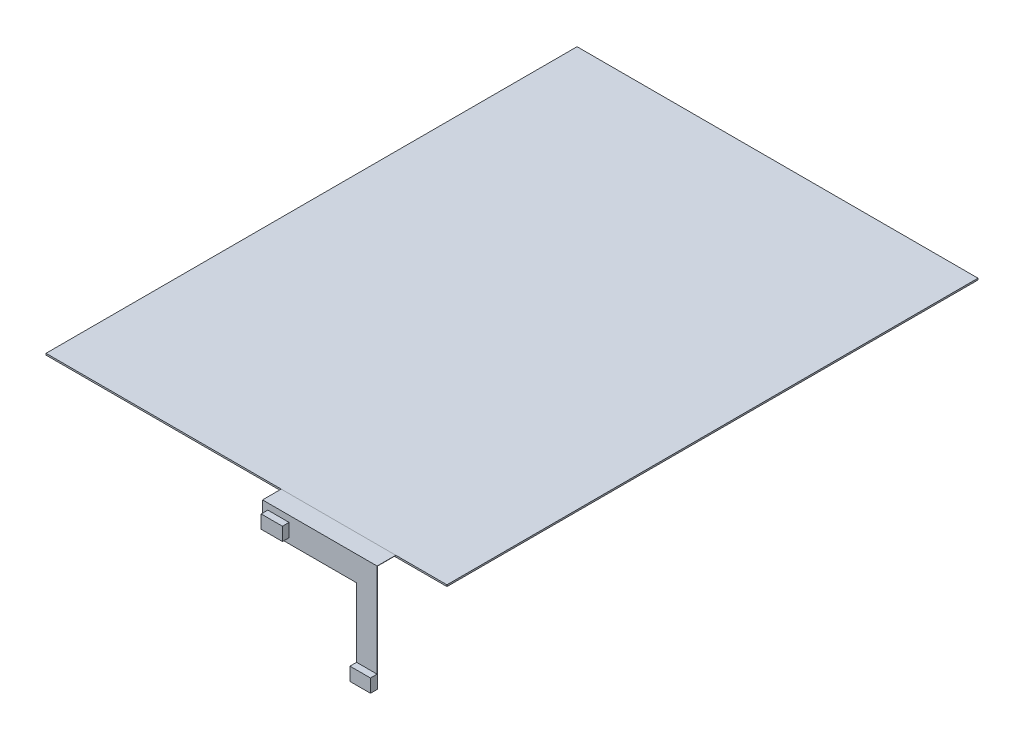
ISO-10303-21;
HEADER;
FILE_DESCRIPTION(('STEP AP214'),'2;1');
FILE_NAME('part.step','',(''),(''),'','','');
FILE_SCHEMA(('AUTOMOTIVE_DESIGN { 1 0 10303 214 1 1 1 1 }'));
ENDSEC;
DATA;
#1=APPLICATION_CONTEXT('core data for automotive mechanical design processes');
#2=APPLICATION_PROTOCOL_DEFINITION('international standard','automotive_design',2000,#1);
#3=PRODUCT_CONTEXT('',#1,'mechanical');
#4=PRODUCT('Part','Part','',(#3));
#5=PRODUCT_RELATED_PRODUCT_CATEGORY('part','',(#4));
#6=PRODUCT_DEFINITION_FORMATION('','',#4);
#7=PRODUCT_DEFINITION_CONTEXT('part definition',#1,'design');
#8=PRODUCT_DEFINITION('design','',#6,#7);
#9=PRODUCT_DEFINITION_SHAPE('','',#8);
#10=(LENGTH_UNIT() NAMED_UNIT(*) SI_UNIT(.MILLI.,.METRE.));
#11=(NAMED_UNIT(*) PLANE_ANGLE_UNIT() SI_UNIT($,.RADIAN.));
#12=(NAMED_UNIT(*) SI_UNIT($,.STERADIAN.) SOLID_ANGLE_UNIT());
#13=UNCERTAINTY_MEASURE_WITH_UNIT(LENGTH_MEASURE(1.E-05),#10,'distance_accuracy_value','');
#14=(GEOMETRIC_REPRESENTATION_CONTEXT(3) GLOBAL_UNCERTAINTY_ASSIGNED_CONTEXT((#13)) GLOBAL_UNIT_ASSIGNED_CONTEXT((#10,
#11,#12)) REPRESENTATION_CONTEXT('',''));
#15=CARTESIAN_POINT('',(0.,0.,0.));
#16=DIRECTION('',(0.,0.,1.));
#17=DIRECTION('',(1.,0.,0.));
#18=AXIS2_PLACEMENT_3D('',#15,#16,#17);
#19=CARTESIAN_POINT('',(56.2333726035956,0.5,107.038276069715));
#20=DIRECTION('',(0.,0.,1.));
#21=DIRECTION('',(1.,0.,0.));
#22=AXIS2_PLACEMENT_3D('',#19,#20,#21);
#23=PLANE('',#22);
#24=DIRECTION('',(-1.,0.,0.));
#25=VECTOR('',#24,1.);
#26=CARTESIAN_POINT('',(48.507284639132,-34.6648367445099,107.038276069715));
#27=LINE('',#26,#25);
#28=CARTESIAN_POINT('',(56.2333726035956,-34.6648367445099,107.038276069715));
#29=VERTEX_POINT('',#28);
#30=CARTESIAN_POINT('',(48.507284639132,-34.6648367445099,107.038276069715));
#31=VERTEX_POINT('',#30);
#32=EDGE_CURVE('E72',#29,#31,#27,.T.);
#33=ORIENTED_EDGE('',*,*,#32,.F.);
#34=DIRECTION('',(0.,1.,0.));
#35=VECTOR('',#34,1.);
#36=CARTESIAN_POINT('',(56.2333726035956,0.5,107.038276069715));
#37=LINE('',#36,#35);
#38=CARTESIAN_POINT('',(56.2333726035956,0.6,107.038276069715));
#39=VERTEX_POINT('',#38);
#40=EDGE_CURVE('E56',#29,#39,#37,.T.);
#41=ORIENTED_EDGE('',*,*,#40,.T.);
#42=DIRECTION('',(1.,0.,0.));
#43=VECTOR('',#42,1.);
#44=CARTESIAN_POINT('',(56.2333726035956,0.6,107.038276069715));
#45=LINE('',#44,#43);
#46=CARTESIAN_POINT('',(13.0840025364802,0.6,107.038276069715));
#47=VERTEX_POINT('',#46);
#48=EDGE_CURVE('E254',#47,#39,#45,.T.);
#49=ORIENTED_EDGE('',*,*,#48,.F.);
#50=DIRECTION('',(0.,1.,0.));
#51=VECTOR('',#50,1.);
#52=CARTESIAN_POINT('',(13.0840025364802,0.5,107.038276069715));
#53=LINE('',#52,#51);
#54=CARTESIAN_POINT('',(13.0840025364802,-8.74016219641922,107.038276069715));
#55=VERTEX_POINT('',#54);
#56=EDGE_CURVE('E261',#55,#47,#53,.T.);
#57=ORIENTED_EDGE('',*,*,#56,.F.);
#58=DIRECTION('',(1.,0.,0.));
#59=VECTOR('',#58,1.);
#60=CARTESIAN_POINT('',(48.507284639132,-8.74016219641922,107.038276069715));
#61=LINE('',#60,#59);
#62=CARTESIAN_POINT('',(48.507284639132,-8.74016219641922,107.038276069715));
#63=VERTEX_POINT('',#62);
#64=EDGE_CURVE('E203',#55,#63,#61,.T.);
#65=ORIENTED_EDGE('',*,*,#64,.T.);
#66=DIRECTION('',(0.,-1.,0.));
#67=VECTOR('',#66,1.);
#68=CARTESIAN_POINT('',(48.507284639132,-39.6648367445099,107.038276069715));
#69=LINE('',#68,#67);
#70=EDGE_CURVE('E208',#63,#31,#69,.T.);
#71=ORIENTED_EDGE('',*,*,#70,.T.);
#72=EDGE_LOOP('',(#33,#41,#49,#57,#65,#71));
#73=FACE_BOUND('',#72,.T.);
#74=DIRECTION('',(1.,0.,0.));
#75=VECTOR('',#74,1.);
#76=CARTESIAN_POINT('',(15.0840025364802,-6.74016219641922,107.038276069715));
#77=LINE('',#76,#75);
#78=CARTESIAN_POINT('',(15.0840025364802,-6.74016219641922,107.038276069715));
#79=VERTEX_POINT('',#78);
#80=CARTESIAN_POINT('',(23.0840025364802,-6.74016219641922,107.038276069715));
#81=VERTEX_POINT('',#80);
#82=EDGE_CURVE('E453',#79,#81,#77,.T.);
#83=ORIENTED_EDGE('',*,*,#82,.F.);
#84=DIRECTION('',(0.,-1.,0.));
#85=VECTOR('',#84,1.);
#86=CARTESIAN_POINT('',(15.0840025364802,-1.74016219641922,107.038276069715));
#87=LINE('',#86,#85);
#88=CARTESIAN_POINT('',(15.0840025364802,-1.74016219641922,107.038276069715));
#89=VERTEX_POINT('',#88);
#90=EDGE_CURVE('E172',#89,#79,#87,.T.);
#91=ORIENTED_EDGE('',*,*,#90,.F.);
#92=DIRECTION('',(-1.,0.,0.));
#93=VECTOR('',#92,1.);
#94=CARTESIAN_POINT('',(15.0840025364802,-1.74016219641922,107.038276069715));
#95=LINE('',#94,#93);
#96=CARTESIAN_POINT('',(23.0840025364802,-1.74016219641922,107.038276069715));
#97=VERTEX_POINT('',#96);
#98=EDGE_CURVE('E168',#97,#89,#95,.T.);
#99=ORIENTED_EDGE('',*,*,#98,.F.);
#100=DIRECTION('',(0.,1.,0.));
#101=VECTOR('',#100,1.);
#102=CARTESIAN_POINT('',(23.0840025364802,-1.74016219641922,107.038276069715));
#103=LINE('',#102,#101);
#104=EDGE_CURVE('E450',#81,#97,#103,.T.);
#105=ORIENTED_EDGE('',*,*,#104,.F.);
#106=EDGE_LOOP('',(#83,#91,#99,#105));
#107=FACE_BOUND('',#106,.T.);
#108=ADVANCED_FACE('F47',(#73,#107),#23,.T.);
#109=CARTESIAN_POINT('',(0.,0.5,0.));
#110=DIRECTION('',(0.,-1.,0.));
#111=DIRECTION('',(0.,0.,-1.));
#112=AXIS2_PLACEMENT_3D('',#109,#110,#111);
#113=PLANE('',#112);
#114=DIRECTION('',(0.,0.,-1.));
#115=VECTOR('',#114,1.);
#116=CARTESIAN_POINT('',(56.2333726035956,0.5,100.));
#117=LINE('',#116,#115);
#118=CARTESIAN_POINT('',(56.2333726035956,0.5,106.938276069715));
#119=VERTEX_POINT('',#118);
#120=CARTESIAN_POINT('',(56.2333726035956,0.5,100.));
#121=VERTEX_POINT('',#120);
#122=EDGE_CURVE('E239',#119,#121,#117,.T.);
#123=ORIENTED_EDGE('',*,*,#122,.F.);
#124=DIRECTION('',(-1.,0.,0.));
#125=VECTOR('',#124,1.);
#126=CARTESIAN_POINT('',(13.0840025364802,0.5,106.938276069715));
#127=LINE('',#126,#125);
#128=CARTESIAN_POINT('',(13.0840025364802,0.5,106.938276069715));
#129=VERTEX_POINT('',#128);
#130=EDGE_CURVE('E211',#119,#129,#127,.T.);
#131=ORIENTED_EDGE('',*,*,#130,.T.);
#132=DIRECTION('',(0.,0.,1.));
#133=VECTOR('',#132,1.);
#134=CARTESIAN_POINT('',(13.0840025364802,0.5,107.038276069715));
#135=LINE('',#134,#133);
#136=CARTESIAN_POINT('',(13.0840025364802,0.5,100.));
#137=VERTEX_POINT('',#136);
#138=EDGE_CURVE('E235',#137,#129,#135,.T.);
#139=ORIENTED_EDGE('',*,*,#138,.F.);
#140=DIRECTION('',(-1.,0.,0.));
#141=VECTOR('',#140,1.);
#142=CARTESIAN_POINT('',(13.0840025364802,0.5,100.));
#143=LINE('',#142,#141);
#144=EDGE_CURVE('E240',#121,#137,#143,.T.);
#145=ORIENTED_EDGE('',*,*,#144,.F.);
#146=EDGE_LOOP('',(#123,#131,#139,#145));
#147=FACE_BOUND('',#146,.T.);
#148=ADVANCED_FACE('F276',(#147),#113,.T.);
#149=CARTESIAN_POINT('',(13.0840025364802,0.5,100.));
#150=DIRECTION('',(0.,0.,-1.));
#151=DIRECTION('',(-1.,0.,0.));
#152=AXIS2_PLACEMENT_3D('',#149,#150,#151);
#153=PLANE('',#152);
#154=DIRECTION('',(-1.,0.,0.));
#155=VECTOR('',#154,1.);
#156=CARTESIAN_POINT('',(13.0840025364802,0.6,100.));
#157=LINE('',#156,#155);
#158=CARTESIAN_POINT('',(56.2333726035956,0.6,100.));
#159=VERTEX_POINT('',#158);
#160=CARTESIAN_POINT('',(13.0840025364802,0.6,100.));
#161=VERTEX_POINT('',#160);
#162=EDGE_CURVE('E248',#159,#161,#157,.T.);
#163=ORIENTED_EDGE('',*,*,#162,.F.);
#164=DIRECTION('',(0.,1.,0.));
#165=VECTOR('',#164,1.);
#166=CARTESIAN_POINT('',(56.2333726035956,0.5,100.));
#167=LINE('',#166,#165);
#168=EDGE_CURVE('E12',#121,#159,#167,.T.);
#169=ORIENTED_EDGE('',*,*,#168,.F.);
#170=ORIENTED_EDGE('',*,*,#144,.T.);
#171=DIRECTION('',(0.,1.,0.));
#172=VECTOR('',#171,1.);
#173=CARTESIAN_POINT('',(13.0840025364802,0.5,100.));
#174=LINE('',#173,#172);
#175=EDGE_CURVE('E262',#137,#161,#174,.T.);
#176=ORIENTED_EDGE('',*,*,#175,.T.);
#177=EDGE_LOOP('',(#163,#169,#170,#176));
#178=FACE_BOUND('',#177,.T.);
#179=ADVANCED_FACE('F49',(#178),#153,.T.);
#180=CARTESIAN_POINT('',(56.2333726035956,0.5,100.));
#181=DIRECTION('',(1.,0.,0.));
#182=DIRECTION('',(0.,0.,-1.));
#183=AXIS2_PLACEMENT_3D('',#180,#181,#182);
#184=PLANE('',#183);
#185=DIRECTION('',(0.,0.,-1.));
#186=VECTOR('',#185,1.);
#187=CARTESIAN_POINT('',(56.2333726035956,0.6,100.));
#188=LINE('',#187,#186);
#189=EDGE_CURVE('E257',#39,#159,#188,.T.);
#190=ORIENTED_EDGE('',*,*,#189,.F.);
#191=ORIENTED_EDGE('',*,*,#40,.F.);
#192=DIRECTION('',(0.,0.,-1.));
#193=VECTOR('',#192,1.);
#194=CARTESIAN_POINT('',(56.2333726035956,-34.6648367445099,109.538276069715));
#195=LINE('',#194,#193);
#196=CARTESIAN_POINT('',(56.2333726035956,-34.6648367445099,109.538276069715));
#197=VERTEX_POINT('',#196);
#198=EDGE_CURVE('E200',#197,#29,#195,.T.);
#199=ORIENTED_EDGE('',*,*,#198,.F.);
#200=DIRECTION('',(0.,1.,0.));
#201=VECTOR('',#200,1.);
#202=CARTESIAN_POINT('',(56.2333726035956,-39.6648367445099,109.538276069715));
#203=LINE('',#202,#201);
#204=CARTESIAN_POINT('',(56.2333726035956,-39.6648367445099,109.538276069715));
#205=VERTEX_POINT('',#204);
#206=EDGE_CURVE('E185',#205,#197,#203,.T.);
#207=ORIENTED_EDGE('',*,*,#206,.F.);
#208=DIRECTION('',(0.,0.,1.));
#209=VECTOR('',#208,1.);
#210=CARTESIAN_POINT('',(56.2333726035956,-39.6648367445099,106.938276069715));
#211=LINE('',#210,#209);
#212=CARTESIAN_POINT('',(56.2333726035956,-39.6648367445099,106.938276069715));
#213=VERTEX_POINT('',#212);
#214=EDGE_CURVE('E218',#213,#205,#211,.T.);
#215=ORIENTED_EDGE('',*,*,#214,.F.);
#216=DIRECTION('',(0.,1.,0.));
#217=VECTOR('',#216,1.);
#218=CARTESIAN_POINT('',(56.2333726035956,0.5,106.938276069715));
#219=LINE('',#218,#217);
#220=EDGE_CURVE('E223',#213,#119,#219,.T.);
#221=ORIENTED_EDGE('',*,*,#220,.T.);
#222=ORIENTED_EDGE('',*,*,#122,.T.);
#223=ORIENTED_EDGE('',*,*,#168,.T.);
#224=EDGE_LOOP('',(#190,#191,#199,#207,#215,#221,#222,#223));
#225=FACE_BOUND('',#224,.T.);
#226=ADVANCED_FACE('F271',(#225),#184,.T.);
#227=CARTESIAN_POINT('',(13.0840025364802,0.5,107.038276069715));
#228=DIRECTION('',(-1.,0.,0.));
#229=DIRECTION('',(0.,0.,1.));
#230=AXIS2_PLACEMENT_3D('',#227,#228,#229);
#231=PLANE('',#230);
#232=DIRECTION('',(0.,0.,1.));
#233=VECTOR('',#232,1.);
#234=CARTESIAN_POINT('',(13.0840025364802,0.6,107.038276069715));
#235=LINE('',#234,#233);
#236=EDGE_CURVE('E251',#161,#47,#235,.T.);
#237=ORIENTED_EDGE('',*,*,#236,.F.);
#238=ORIENTED_EDGE('',*,*,#175,.F.);
#239=ORIENTED_EDGE('',*,*,#138,.T.);
#240=DIRECTION('',(0.,-1.,0.));
#241=VECTOR('',#240,1.);
#242=CARTESIAN_POINT('',(13.0840025364802,-8.74016219641922,106.938276069715));
#243=LINE('',#242,#241);
#244=CARTESIAN_POINT('',(13.0840025364802,-8.74016219641922,106.938276069715));
#245=VERTEX_POINT('',#244);
#246=EDGE_CURVE('E229',#129,#245,#243,.T.);
#247=ORIENTED_EDGE('',*,*,#246,.T.);
#248=DIRECTION('',(0.,0.,1.));
#249=VECTOR('',#248,1.);
#250=CARTESIAN_POINT('',(13.0840025364802,-8.74016219641922,106.938276069715));
#251=LINE('',#250,#249);
#252=EDGE_CURVE('E226',#245,#55,#251,.T.);
#253=ORIENTED_EDGE('',*,*,#252,.T.);
#254=ORIENTED_EDGE('',*,*,#56,.T.);
#255=EDGE_LOOP('',(#237,#238,#239,#247,#253,#254));
#256=FACE_BOUND('',#255,.T.);
#257=ADVANCED_FACE('F278',(#256),#231,.T.);
#258=CARTESIAN_POINT('',(0.,0.6,0.));
#259=DIRECTION('',(0.,-1.,0.));
#260=DIRECTION('',(0.,0.,-1.));
#261=AXIS2_PLACEMENT_3D('',#258,#259,#260);
#262=PLANE('',#261);
#263=ORIENTED_EDGE('',*,*,#162,.T.);
#264=ORIENTED_EDGE('',*,*,#236,.T.);
#265=ORIENTED_EDGE('',*,*,#48,.T.);
#266=ORIENTED_EDGE('',*,*,#189,.T.);
#267=EDGE_LOOP('',(#263,#264,#265,#266));
#268=FACE_BOUND('',#267,.T.);
#269=ADVANCED_FACE('F282',(#268),#262,.F.);
#270=CARTESIAN_POINT('',(56.2333726035956,-39.6648367445099,106.938276069715));
#271=DIRECTION('',(0.,-1.,0.));
#272=DIRECTION('',(0.,0.,-1.));
#273=AXIS2_PLACEMENT_3D('',#270,#271,#272);
#274=PLANE('',#273);
#275=ORIENTED_EDGE('',*,*,#214,.T.);
#276=DIRECTION('',(1.,0.,0.));
#277=VECTOR('',#276,1.);
#278=CARTESIAN_POINT('',(48.507284639132,-39.6648367445099,109.538276069715));
#279=LINE('',#278,#277);
#280=CARTESIAN_POINT('',(48.507284639132,-39.6648367445099,109.538276069715));
#281=VERTEX_POINT('',#280);
#282=EDGE_CURVE('E182',#281,#205,#279,.T.);
#283=ORIENTED_EDGE('',*,*,#282,.F.);
#284=DIRECTION('',(0.,0.,1.));
#285=VECTOR('',#284,1.);
#286=CARTESIAN_POINT('',(48.507284639132,-39.6648367445099,106.938276069715));
#287=LINE('',#286,#285);
#288=CARTESIAN_POINT('',(48.507284639132,-39.6648367445099,106.938276069715));
#289=VERTEX_POINT('',#288);
#290=EDGE_CURVE('E294',#289,#281,#287,.T.);
#291=ORIENTED_EDGE('',*,*,#290,.F.);
#292=DIRECTION('',(1.,0.,0.));
#293=VECTOR('',#292,1.);
#294=CARTESIAN_POINT('',(56.2333726035956,-39.6648367445099,106.938276069715));
#295=LINE('',#294,#293);
#296=EDGE_CURVE('E214',#289,#213,#295,.T.);
#297=ORIENTED_EDGE('',*,*,#296,.T.);
#298=EDGE_LOOP('',(#275,#283,#291,#297));
#299=FACE_BOUND('',#298,.T.);
#300=ADVANCED_FACE('F306',(#299),#274,.T.);
#301=CARTESIAN_POINT('',(48.507284639132,-39.6648367445099,106.938276069715));
#302=DIRECTION('',(-1.,0.,0.));
#303=DIRECTION('',(0.,0.,1.));
#304=AXIS2_PLACEMENT_3D('',#301,#302,#303);
#305=PLANE('',#304);
#306=ORIENTED_EDGE('',*,*,#70,.F.);
#307=DIRECTION('',(0.,0.,1.));
#308=VECTOR('',#307,1.);
#309=CARTESIAN_POINT('',(48.507284639132,-8.74016219641922,106.938276069715));
#310=LINE('',#309,#308);
#311=CARTESIAN_POINT('',(48.507284639132,-8.74016219641922,106.938276069715));
#312=VERTEX_POINT('',#311);
#313=EDGE_CURVE('E288',#312,#63,#310,.T.);
#314=ORIENTED_EDGE('',*,*,#313,.F.);
#315=DIRECTION('',(0.,-1.,0.));
#316=VECTOR('',#315,1.);
#317=CARTESIAN_POINT('',(48.507284639132,-39.6648367445099,106.938276069715));
#318=LINE('',#317,#316);
#319=EDGE_CURVE('E308',#312,#289,#318,.T.);
#320=ORIENTED_EDGE('',*,*,#319,.T.);
#321=ORIENTED_EDGE('',*,*,#290,.T.);
#322=DIRECTION('',(0.,-1.,0.));
#323=VECTOR('',#322,1.);
#324=CARTESIAN_POINT('',(48.507284639132,-39.6648367445099,109.538276069715));
#325=LINE('',#324,#323);
#326=CARTESIAN_POINT('',(48.507284639132,-34.6648367445099,109.538276069715));
#327=VERTEX_POINT('',#326);
#328=EDGE_CURVE('E175',#327,#281,#325,.T.);
#329=ORIENTED_EDGE('',*,*,#328,.F.);
#330=DIRECTION('',(0.,0.,-1.));
#331=VECTOR('',#330,1.);
#332=CARTESIAN_POINT('',(48.507284639132,-34.6648367445099,109.538276069715));
#333=LINE('',#332,#331);
#334=EDGE_CURVE('E189',#327,#31,#333,.T.);
#335=ORIENTED_EDGE('',*,*,#334,.T.);
#336=EDGE_LOOP('',(#306,#314,#320,#321,#329,#335));
#337=FACE_BOUND('',#336,.T.);
#338=ADVANCED_FACE('F296',(#337),#305,.T.);
#339=CARTESIAN_POINT('',(48.507284639132,-8.74016219641922,106.938276069715));
#340=DIRECTION('',(0.,-1.,0.));
#341=DIRECTION('',(0.,0.,-1.));
#342=AXIS2_PLACEMENT_3D('',#339,#340,#341);
#343=PLANE('',#342);
#344=ORIENTED_EDGE('',*,*,#64,.F.);
#345=ORIENTED_EDGE('',*,*,#252,.F.);
#346=DIRECTION('',(1.,0.,0.));
#347=VECTOR('',#346,1.);
#348=CARTESIAN_POINT('',(48.507284639132,-8.74016219641922,106.938276069715));
#349=LINE('',#348,#347);
#350=EDGE_CURVE('E232',#245,#312,#349,.T.);
#351=ORIENTED_EDGE('',*,*,#350,.T.);
#352=ORIENTED_EDGE('',*,*,#313,.T.);
#353=EDGE_LOOP('',(#344,#345,#351,#352));
#354=FACE_BOUND('',#353,.T.);
#355=ADVANCED_FACE('F289',(#354),#343,.T.);
#356=CARTESIAN_POINT('',(0.,0.,106.938276069715));
#357=DIRECTION('',(0.,0.,-1.));
#358=DIRECTION('',(-1.,0.,0.));
#359=AXIS2_PLACEMENT_3D('',#356,#357,#358);
#360=PLANE('',#359);
#361=ORIENTED_EDGE('',*,*,#130,.F.);
#362=ORIENTED_EDGE('',*,*,#220,.F.);
#363=ORIENTED_EDGE('',*,*,#296,.F.);
#364=ORIENTED_EDGE('',*,*,#319,.F.);
#365=ORIENTED_EDGE('',*,*,#350,.F.);
#366=ORIENTED_EDGE('',*,*,#246,.F.);
#367=EDGE_LOOP('',(#361,#362,#363,#364,#365,#366));
#368=FACE_BOUND('',#367,.T.);
#369=ADVANCED_FACE('F309',(#368),#360,.T.);
#370=CARTESIAN_POINT('',(48.507284639132,-34.6648367445099,109.538276069715));
#371=DIRECTION('',(0.,-1.,0.));
#372=DIRECTION('',(0.,0.,-1.));
#373=AXIS2_PLACEMENT_3D('',#370,#371,#372);
#374=PLANE('',#373);
#375=ORIENTED_EDGE('',*,*,#32,.T.);
#376=ORIENTED_EDGE('',*,*,#334,.F.);
#377=DIRECTION('',(-1.,0.,0.));
#378=VECTOR('',#377,1.);
#379=CARTESIAN_POINT('',(48.507284639132,-34.6648367445099,109.538276069715));
#380=LINE('',#379,#378);
#381=EDGE_CURVE('E187',#197,#327,#380,.T.);
#382=ORIENTED_EDGE('',*,*,#381,.F.);
#383=ORIENTED_EDGE('',*,*,#198,.T.);
#384=EDGE_LOOP('',(#375,#376,#382,#383));
#385=FACE_BOUND('',#384,.T.);
#386=ADVANCED_FACE('F299',(#385),#374,.F.);
#387=CARTESIAN_POINT('',(0.,0.,109.538276069715));
#388=DIRECTION('',(0.,0.,-1.));
#389=DIRECTION('',(-1.,0.,0.));
#390=AXIS2_PLACEMENT_3D('',#387,#388,#389);
#391=PLANE('',#390);
#392=ORIENTED_EDGE('',*,*,#328,.T.);
#393=ORIENTED_EDGE('',*,*,#282,.T.);
#394=ORIENTED_EDGE('',*,*,#206,.T.);
#395=ORIENTED_EDGE('',*,*,#381,.T.);
#396=EDGE_LOOP('',(#392,#393,#394,#395));
#397=FACE_BOUND('',#396,.T.);
#398=ADVANCED_FACE('F302',(#397),#391,.F.);
#399=CARTESIAN_POINT('',(15.0840025364802,-1.74016219641922,109.538276069715));
#400=DIRECTION('',(1.,0.,0.));
#401=DIRECTION('',(0.,0.,-1.));
#402=AXIS2_PLACEMENT_3D('',#399,#400,#401);
#403=PLANE('',#402);
#404=ORIENTED_EDGE('',*,*,#90,.T.);
#405=DIRECTION('',(0.,0.,-1.));
#406=VECTOR('',#405,1.);
#407=CARTESIAN_POINT('',(15.0840025364802,-6.74016219641922,109.538276069715));
#408=LINE('',#407,#406);
#409=CARTESIAN_POINT('',(15.0840025364802,-6.74016219641922,109.538276069715));
#410=VERTEX_POINT('',#409);
#411=EDGE_CURVE('E153',#410,#79,#408,.T.);
#412=ORIENTED_EDGE('',*,*,#411,.F.);
#413=DIRECTION('',(0.,-1.,0.));
#414=VECTOR('',#413,1.);
#415=CARTESIAN_POINT('',(15.0840025364802,-1.74016219641922,109.538276069715));
#416=LINE('',#415,#414);
#417=CARTESIAN_POINT('',(15.0840025364802,-1.74016219641922,109.538276069715));
#418=VERTEX_POINT('',#417);
#419=EDGE_CURVE('E160',#418,#410,#416,.T.);
#420=ORIENTED_EDGE('',*,*,#419,.F.);
#421=DIRECTION('',(0.,0.,-1.));
#422=VECTOR('',#421,1.);
#423=CARTESIAN_POINT('',(15.0840025364802,-1.74016219641922,109.538276069715));
#424=LINE('',#423,#422);
#425=EDGE_CURVE('E448',#418,#89,#424,.T.);
#426=ORIENTED_EDGE('',*,*,#425,.T.);
#427=EDGE_LOOP('',(#404,#412,#420,#426));
#428=FACE_BOUND('',#427,.T.);
#429=ADVANCED_FACE('F170',(#428),#403,.F.);
#430=CARTESIAN_POINT('',(15.0840025364802,-6.74016219641922,109.538276069715));
#431=DIRECTION('',(0.,1.,0.));
#432=DIRECTION('',(-1.,0.,0.));
#433=AXIS2_PLACEMENT_3D('',#430,#431,#432);
#434=PLANE('',#433);
#435=ORIENTED_EDGE('',*,*,#82,.T.);
#436=DIRECTION('',(0.,0.,-1.));
#437=VECTOR('',#436,1.);
#438=CARTESIAN_POINT('',(23.0840025364802,-6.74016219641922,109.538276069715));
#439=LINE('',#438,#437);
#440=CARTESIAN_POINT('',(23.0840025364802,-6.74016219641922,109.538276069715));
#441=VERTEX_POINT('',#440);
#442=EDGE_CURVE('E156',#441,#81,#439,.T.);
#443=ORIENTED_EDGE('',*,*,#442,.F.);
#444=DIRECTION('',(1.,0.,0.));
#445=VECTOR('',#444,1.);
#446=CARTESIAN_POINT('',(15.0840025364802,-6.74016219641922,109.538276069715));
#447=LINE('',#446,#445);
#448=EDGE_CURVE('E149',#410,#441,#447,.T.);
#449=ORIENTED_EDGE('',*,*,#448,.F.);
#450=ORIENTED_EDGE('',*,*,#411,.T.);
#451=EDGE_LOOP('',(#435,#443,#449,#450));
#452=FACE_BOUND('',#451,.T.);
#453=ADVANCED_FACE('F151',(#452),#434,.F.);
#454=CARTESIAN_POINT('',(23.0840025364802,-1.74016219641922,109.538276069715));
#455=DIRECTION('',(-1.,0.,0.));
#456=DIRECTION('',(0.,-1.,0.));
#457=AXIS2_PLACEMENT_3D('',#454,#455,#456);
#458=PLANE('',#457);
#459=ORIENTED_EDGE('',*,*,#104,.T.);
#460=DIRECTION('',(0.,0.,-1.));
#461=VECTOR('',#460,1.);
#462=CARTESIAN_POINT('',(23.0840025364802,-1.74016219641922,109.538276069715));
#463=LINE('',#462,#461);
#464=CARTESIAN_POINT('',(23.0840025364802,-1.74016219641922,109.538276069715));
#465=VERTEX_POINT('',#464);
#466=EDGE_CURVE('E64',#465,#97,#463,.T.);
#467=ORIENTED_EDGE('',*,*,#466,.F.);
#468=DIRECTION('',(0.,1.,0.));
#469=VECTOR('',#468,1.);
#470=CARTESIAN_POINT('',(23.0840025364802,-1.74016219641922,109.538276069715));
#471=LINE('',#470,#469);
#472=EDGE_CURVE('E159',#441,#465,#471,.T.);
#473=ORIENTED_EDGE('',*,*,#472,.F.);
#474=ORIENTED_EDGE('',*,*,#442,.T.);
#475=EDGE_LOOP('',(#459,#467,#473,#474));
#476=FACE_BOUND('',#475,.T.);
#477=ADVANCED_FACE('F417',(#476),#458,.F.);
#478=CARTESIAN_POINT('',(15.0840025364802,-1.74016219641922,109.538276069715));
#479=DIRECTION('',(0.,-1.,0.));
#480=DIRECTION('',(0.,0.,-1.));
#481=AXIS2_PLACEMENT_3D('',#478,#479,#480);
#482=PLANE('',#481);
#483=ORIENTED_EDGE('',*,*,#98,.T.);
#484=ORIENTED_EDGE('',*,*,#425,.F.);
#485=DIRECTION('',(-1.,0.,0.));
#486=VECTOR('',#485,1.);
#487=CARTESIAN_POINT('',(15.0840025364802,-1.74016219641922,109.538276069715));
#488=LINE('',#487,#486);
#489=EDGE_CURVE('E164',#465,#418,#488,.T.);
#490=ORIENTED_EDGE('',*,*,#489,.F.);
#491=ORIENTED_EDGE('',*,*,#466,.T.);
#492=EDGE_LOOP('',(#483,#484,#490,#491));
#493=FACE_BOUND('',#492,.T.);
#494=ADVANCED_FACE('F426',(#493),#482,.F.);
#495=CARTESIAN_POINT('',(0.,0.,109.538276069715));
#496=DIRECTION('',(0.,0.,1.));
#497=DIRECTION('',(1.,0.,0.));
#498=AXIS2_PLACEMENT_3D('',#495,#496,#497);
#499=PLANE('',#498);
#500=ORIENTED_EDGE('',*,*,#419,.T.);
#501=ORIENTED_EDGE('',*,*,#448,.T.);
#502=ORIENTED_EDGE('',*,*,#472,.T.);
#503=ORIENTED_EDGE('',*,*,#489,.T.);
#504=EDGE_LOOP('',(#500,#501,#502,#503));
#505=FACE_BOUND('',#504,.T.);
#506=ADVANCED_FACE('F163',(#505),#499,.T.);
#507=CLOSED_SHELL('',(#108,#148,#179,#226,#257,#269,#300,#338,#355,#369,#386,#398,#429,#453,
#477,#494,#506));
#508=MANIFOLD_SOLID_BREP('B2',#507);
#509=CARTESIAN_POINT('',(-75.5,0.6,100.));
#510=DIRECTION('',(1.,0.,0.));
#511=DIRECTION('',(0.,0.,-1.));
#512=AXIS2_PLACEMENT_3D('',#509,#510,#511);
#513=PLANE('',#512);
#514=DIRECTION('',(0.,0.,1.));
#515=VECTOR('',#514,1.);
#516=CARTESIAN_POINT('',(-75.5,0.,100.));
#517=LINE('',#516,#515);
#518=CARTESIAN_POINT('',(-75.5,0.,-100.));
#519=VERTEX_POINT('',#518);
#520=CARTESIAN_POINT('',(-75.5,0.,100.));
#521=VERTEX_POINT('',#520);
#522=EDGE_CURVE('E543',#519,#521,#517,.T.);
#523=ORIENTED_EDGE('',*,*,#522,.T.);
#524=DIRECTION('',(0.,-1.,0.));
#525=VECTOR('',#524,1.);
#526=CARTESIAN_POINT('',(-75.5,0.6,100.));
#527=LINE('',#526,#525);
#528=CARTESIAN_POINT('',(-75.5,0.6,100.));
#529=VERTEX_POINT('',#528);
#530=EDGE_CURVE('E45',#529,#521,#527,.T.);
#531=ORIENTED_EDGE('',*,*,#530,.F.);
#532=DIRECTION('',(0.,0.,1.));
#533=VECTOR('',#532,1.);
#534=CARTESIAN_POINT('',(-75.5,0.6,100.));
#535=LINE('',#534,#533);
#536=CARTESIAN_POINT('',(-75.5,0.6,-100.));
#537=VERTEX_POINT('',#536);
#538=EDGE_CURVE('E531',#537,#529,#535,.T.);
#539=ORIENTED_EDGE('',*,*,#538,.F.);
#540=DIRECTION('',(0.,-1.,0.));
#541=VECTOR('',#540,1.);
#542=CARTESIAN_POINT('',(-75.5,0.6,-100.));
#543=LINE('',#542,#541);
#544=EDGE_CURVE('E539',#537,#519,#543,.T.);
#545=ORIENTED_EDGE('',*,*,#544,.T.);
#546=EDGE_LOOP('',(#523,#531,#539,#545));
#547=FACE_BOUND('',#546,.T.);
#548=ADVANCED_FACE('F480',(#547),#513,.F.);
#549=CARTESIAN_POINT('',(75.5,0.6,100.));
#550=DIRECTION('',(0.,0.,-1.));
#551=DIRECTION('',(-1.,0.,0.));
#552=AXIS2_PLACEMENT_3D('',#549,#550,#551);
#553=PLANE('',#552);
#554=DIRECTION('',(1.,0.,0.));
#555=VECTOR('',#554,1.);
#556=CARTESIAN_POINT('',(75.5,0.,100.));
#557=LINE('',#556,#555);
#558=CARTESIAN_POINT('',(75.5,0.,100.));
#559=VERTEX_POINT('',#558);
#560=EDGE_CURVE('E535',#521,#559,#557,.T.);
#561=ORIENTED_EDGE('',*,*,#560,.T.);
#562=DIRECTION('',(0.,-1.,0.));
#563=VECTOR('',#562,1.);
#564=CARTESIAN_POINT('',(75.5,0.6,100.));
#565=LINE('',#564,#563);
#566=CARTESIAN_POINT('',(75.5,0.6,100.));
#567=VERTEX_POINT('',#566);
#568=EDGE_CURVE('E488',#567,#559,#565,.T.);
#569=ORIENTED_EDGE('',*,*,#568,.F.);
#570=DIRECTION('',(1.,0.,0.));
#571=VECTOR('',#570,1.);
#572=CARTESIAN_POINT('',(75.5,0.6,100.));
#573=LINE('',#572,#571);
#574=EDGE_CURVE('E526',#529,#567,#573,.T.);
#575=ORIENTED_EDGE('',*,*,#574,.F.);
#576=ORIENTED_EDGE('',*,*,#530,.T.);
#577=EDGE_LOOP('',(#561,#569,#575,#576));
#578=FACE_BOUND('',#577,.T.);
#579=ADVANCED_FACE('F534',(#578),#553,.F.);
#580=CARTESIAN_POINT('',(75.5,0.6,100.));
#581=DIRECTION('',(-1.,0.,0.));
#582=DIRECTION('',(0.,0.,1.));
#583=AXIS2_PLACEMENT_3D('',#580,#581,#582);
#584=PLANE('',#583);
#585=DIRECTION('',(0.,0.,-1.));
#586=VECTOR('',#585,1.);
#587=CARTESIAN_POINT('',(75.5,0.,100.));
#588=LINE('',#587,#586);
#589=CARTESIAN_POINT('',(75.5,0.,-100.));
#590=VERTEX_POINT('',#589);
#591=EDGE_CURVE('E513',#559,#590,#588,.T.);
#592=ORIENTED_EDGE('',*,*,#591,.T.);
#593=DIRECTION('',(0.,-1.,0.));
#594=VECTOR('',#593,1.);
#595=CARTESIAN_POINT('',(75.5,0.6,-100.));
#596=LINE('',#595,#594);
#597=CARTESIAN_POINT('',(75.5,0.6,-100.));
#598=VERTEX_POINT('',#597);
#599=EDGE_CURVE('E536',#598,#590,#596,.T.);
#600=ORIENTED_EDGE('',*,*,#599,.F.);
#601=DIRECTION('',(0.,0.,-1.));
#602=VECTOR('',#601,1.);
#603=CARTESIAN_POINT('',(75.5,0.6,100.));
#604=LINE('',#603,#602);
#605=EDGE_CURVE('E529',#567,#598,#604,.T.);
#606=ORIENTED_EDGE('',*,*,#605,.F.);
#607=ORIENTED_EDGE('',*,*,#568,.T.);
#608=EDGE_LOOP('',(#592,#600,#606,#607));
#609=FACE_BOUND('',#608,.T.);
#610=ADVANCED_FACE('F537',(#609),#584,.F.);
#611=CARTESIAN_POINT('',(75.5,0.6,-100.));
#612=DIRECTION('',(0.,0.,1.));
#613=DIRECTION('',(1.,0.,0.));
#614=AXIS2_PLACEMENT_3D('',#611,#612,#613);
#615=PLANE('',#614);
#616=DIRECTION('',(-1.,0.,0.));
#617=VECTOR('',#616,1.);
#618=CARTESIAN_POINT('',(75.5,0.,-100.));
#619=LINE('',#618,#617);
#620=EDGE_CURVE('E519',#590,#519,#619,.T.);
#621=ORIENTED_EDGE('',*,*,#620,.T.);
#622=ORIENTED_EDGE('',*,*,#544,.F.);
#623=DIRECTION('',(-1.,0.,0.));
#624=VECTOR('',#623,1.);
#625=CARTESIAN_POINT('',(75.5,0.6,-100.));
#626=LINE('',#625,#624);
#627=EDGE_CURVE('E496',#598,#537,#626,.T.);
#628=ORIENTED_EDGE('',*,*,#627,.F.);
#629=ORIENTED_EDGE('',*,*,#599,.T.);
#630=EDGE_LOOP('',(#621,#622,#628,#629));
#631=FACE_BOUND('',#630,.T.);
#632=ADVANCED_FACE('F550',(#631),#615,.F.);
#633=CARTESIAN_POINT('',(0.,0.6,0.));
#634=DIRECTION('',(0.,1.,0.));
#635=DIRECTION('',(0.,0.,1.));
#636=AXIS2_PLACEMENT_3D('',#633,#634,#635);
#637=PLANE('',#636);
#638=ORIENTED_EDGE('',*,*,#538,.T.);
#639=ORIENTED_EDGE('',*,*,#574,.T.);
#640=ORIENTED_EDGE('',*,*,#605,.T.);
#641=ORIENTED_EDGE('',*,*,#627,.T.);
#642=EDGE_LOOP('',(#638,#639,#640,#641));
#643=FACE_BOUND('',#642,.T.);
#644=ADVANCED_FACE('F527',(#643),#637,.T.);
#645=CARTESIAN_POINT('',(0.,0.,0.));
#646=DIRECTION('',(0.,1.,0.));
#647=DIRECTION('',(0.,0.,1.));
#648=AXIS2_PLACEMENT_3D('',#645,#646,#647);
#649=PLANE('',#648);
#650=ORIENTED_EDGE('',*,*,#522,.F.);
#651=ORIENTED_EDGE('',*,*,#620,.F.);
#652=ORIENTED_EDGE('',*,*,#591,.F.);
#653=ORIENTED_EDGE('',*,*,#560,.F.);
#654=EDGE_LOOP('',(#650,#651,#652,#653));
#655=FACE_BOUND('',#654,.T.);
#656=ADVANCED_FACE('F553',(#655),#649,.F.);
#657=CLOSED_SHELL('',(#548,#579,#610,#632,#644,#656));
#658=MANIFOLD_SOLID_BREP('B6',#657);
#659=ADVANCED_BREP_SHAPE_REPRESENTATION('',(#18,#508,#658),#14);
#660=SHAPE_DEFINITION_REPRESENTATION(#9,#659);
ENDSEC;
END-ISO-10303-21;
